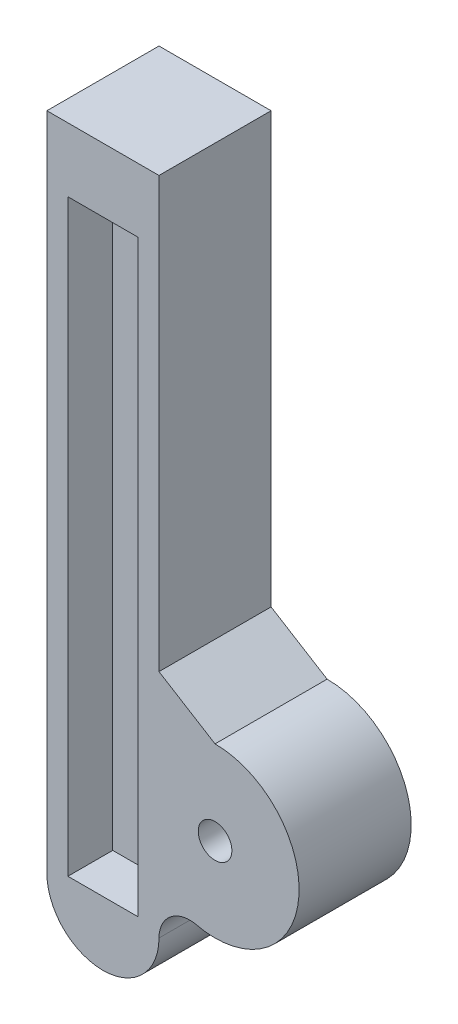
ISO-10303-21;
HEADER;
FILE_DESCRIPTION(('STEP AP214'),'2;1');
FILE_NAME('part.step','',(''),(''),'','','');
FILE_SCHEMA(('AUTOMOTIVE_DESIGN { 1 0 10303 214 1 1 1 1 }'));
ENDSEC;
DATA;
#1=APPLICATION_CONTEXT('core data for automotive mechanical design processes');
#2=APPLICATION_PROTOCOL_DEFINITION('international standard','automotive_design',2000,#1);
#3=PRODUCT_CONTEXT('',#1,'mechanical');
#4=PRODUCT('Part','Part','',(#3));
#5=PRODUCT_RELATED_PRODUCT_CATEGORY('part','',(#4));
#6=PRODUCT_DEFINITION_FORMATION('','',#4);
#7=PRODUCT_DEFINITION_CONTEXT('part definition',#1,'design');
#8=PRODUCT_DEFINITION('design','',#6,#7);
#9=PRODUCT_DEFINITION_SHAPE('','',#8);
#10=(LENGTH_UNIT() NAMED_UNIT(*) SI_UNIT(.MILLI.,.METRE.));
#11=(NAMED_UNIT(*) PLANE_ANGLE_UNIT() SI_UNIT($,.RADIAN.));
#12=(NAMED_UNIT(*) SI_UNIT($,.STERADIAN.) SOLID_ANGLE_UNIT());
#13=UNCERTAINTY_MEASURE_WITH_UNIT(LENGTH_MEASURE(1.E-05),#10,'distance_accuracy_value','');
#14=(GEOMETRIC_REPRESENTATION_CONTEXT(3) GLOBAL_UNCERTAINTY_ASSIGNED_CONTEXT((#13)) GLOBAL_UNIT_ASSIGNED_CONTEXT((#10,
#11,#12)) REPRESENTATION_CONTEXT('',''));
#15=CARTESIAN_POINT('',(0.,0.,0.));
#16=DIRECTION('',(0.,0.,1.));
#17=DIRECTION('',(1.,0.,0.));
#18=AXIS2_PLACEMENT_3D('',#15,#16,#17);
#19=CARTESIAN_POINT('',(-4.47293048602584,-20.,0.));
#20=DIRECTION('',(0.,0.,-1.));
#21=DIRECTION('',(-1.,0.,0.));
#22=AXIS2_PLACEMENT_3D('',#19,#20,#21);
#23=PLANE('',#22);
#24=DIRECTION('',(0.,-1.,0.));
#25=VECTOR('',#24,1.);
#26=CARTESIAN_POINT('',(-26.2499999999999,-18.5850000000001,0.));
#27=LINE('',#26,#25);
#28=CARTESIAN_POINT('',(-26.2500000000003,86.4149999999999,0.));
#29=VERTEX_POINT('',#28);
#30=CARTESIAN_POINT('',(-26.2499999999999,-18.5850000000001,0.));
#31=VERTEX_POINT('',#30);
#32=EDGE_CURVE('E179',#29,#31,#27,.T.);
#33=ORIENTED_EDGE('',*,*,#32,.F.);
#34=DIRECTION('',(-1.,0.,0.));
#35=VECTOR('',#34,1.);
#36=CARTESIAN_POINT('',(-26.2500000000003,86.4149999999999,0.));
#37=LINE('',#36,#35);
#38=CARTESIAN_POINT('',(-13.7500000000003,86.4149999999999,0.));
#39=VERTEX_POINT('',#38);
#40=EDGE_CURVE('E58',#39,#29,#37,.T.);
#41=ORIENTED_EDGE('',*,*,#40,.F.);
#42=DIRECTION('',(0.,1.,0.));
#43=VECTOR('',#42,1.);
#44=CARTESIAN_POINT('',(-13.7499999999999,-18.5850000000001,0.));
#45=LINE('',#44,#43);
#46=CARTESIAN_POINT('',(-13.7499999999999,-18.5850000000001,0.));
#47=VERTEX_POINT('',#46);
#48=EDGE_CURVE('E170',#47,#39,#45,.T.);
#49=ORIENTED_EDGE('',*,*,#48,.F.);
#50=DIRECTION('',(1.,0.,0.));
#51=VECTOR('',#50,1.);
#52=CARTESIAN_POINT('',(-26.2499999999999,-18.5850000000001,0.));
#53=LINE('',#52,#51);
#54=EDGE_CURVE('E173',#31,#47,#53,.T.);
#55=ORIENTED_EDGE('',*,*,#54,.F.);
#56=EDGE_LOOP('',(#33,#41,#49,#55));
#57=FACE_BOUND('',#56,.T.);
#58=CARTESIAN_POINT('',(-4.47293048602584,-20.,0.));
#59=DIRECTION('',(0.,0.,-1.));
#60=DIRECTION('',(-1.,0.,0.));
#61=AXIS2_PLACEMENT_3D('',#58,#59,#60);
#62=CIRCLE('',#61,5.52706951397407);
#63=CARTESIAN_POINT('',(-9.99999999999993,-20.,0.));
#64=VERTEX_POINT('',#63);
#65=CARTESIAN_POINT('',(-3.77527475506118,-14.5171381657611,0.));
#66=VERTEX_POINT('',#65);
#67=EDGE_CURVE('E225',#64,#66,#62,.T.);
#68=ORIENTED_EDGE('',*,*,#67,.T.);
#69=CARTESIAN_POINT('',(0.,0.,0.));
#70=DIRECTION('',(0.,0.,1.));
#71=DIRECTION('',(1.,0.,0.));
#72=AXIS2_PLACEMENT_3D('',#69,#70,#71);
#73=CIRCLE('',#72,15.);
#74=CARTESIAN_POINT('',(0.,15.,0.));
#75=VERTEX_POINT('',#74);
#76=EDGE_CURVE('E228',#66,#75,#73,.T.);
#77=ORIENTED_EDGE('',*,*,#76,.T.);
#78=DIRECTION('',(-0.851405334552162,0.524508299549323,0.));
#79=VECTOR('',#78,1.);
#80=CARTESIAN_POINT('',(0.,15.,0.));
#81=LINE('',#80,#79);
#82=CARTESIAN_POINT('',(-10.0000000000001,21.1605005073784,0.));
#83=VERTEX_POINT('',#82);
#84=EDGE_CURVE('E231',#75,#83,#81,.T.);
#85=ORIENTED_EDGE('',*,*,#84,.T.);
#86=DIRECTION('',(0.,1.,0.));
#87=VECTOR('',#86,1.);
#88=CARTESIAN_POINT('',(-10.0000000000004,97.83,0.));
#89=LINE('',#88,#87);
#90=CARTESIAN_POINT('',(-10.0000000000004,97.83,0.));
#91=VERTEX_POINT('',#90);
#92=EDGE_CURVE('E233',#83,#91,#89,.T.);
#93=ORIENTED_EDGE('',*,*,#92,.T.);
#94=DIRECTION('',(-1.,0.,0.));
#95=VECTOR('',#94,1.);
#96=CARTESIAN_POINT('',(-30.0000000000004,97.8299999999999,1.05384451165591E-13));
#97=LINE('',#96,#95);
#98=CARTESIAN_POINT('',(-30.0000000000004,97.8299999999999,1.05384451165591E-13));
#99=VERTEX_POINT('',#98);
#100=EDGE_CURVE('E235',#91,#99,#97,.T.);
#101=ORIENTED_EDGE('',*,*,#100,.T.);
#102=DIRECTION('',(0.,-1.,0.));
#103=VECTOR('',#102,1.);
#104=CARTESIAN_POINT('',(-29.9999999999999,-20.0000000000001,1.05384451165591E-13));
#105=LINE('',#104,#103);
#106=CARTESIAN_POINT('',(-29.9999999999999,-20.0000000000001,1.05384451165591E-13));
#107=VERTEX_POINT('',#106);
#108=EDGE_CURVE('E237',#99,#107,#105,.T.);
#109=ORIENTED_EDGE('',*,*,#108,.T.);
#110=CARTESIAN_POINT('',(-19.9999999999999,-20.0000000000001,0.));
#111=DIRECTION('',(0.,0.,1.));
#112=DIRECTION('',(-1.,0.,0.));
#113=AXIS2_PLACEMENT_3D('',#110,#111,#112);
#114=CIRCLE('',#113,10.);
#115=EDGE_CURVE('E239',#107,#64,#114,.T.);
#116=ORIENTED_EDGE('',*,*,#115,.T.);
#117=EDGE_LOOP('',(#68,#77,#85,#93,#101,#109,#116));
#118=FACE_BOUND('',#117,.T.);
#119=CARTESIAN_POINT('',(0.,0.,0.));
#120=DIRECTION('',(0.,0.,1.));
#121=DIRECTION('',(1.,0.,0.));
#122=AXIS2_PLACEMENT_3D('',#119,#120,#121);
#123=CIRCLE('',#122,3.);
#124=CARTESIAN_POINT('',(3.,0.,0.));
#125=VERTEX_POINT('',#124);
#126=EDGE_CURVE('E219',#125,#125,#123,.T.);
#127=ORIENTED_EDGE('',*,*,#126,.F.);
#128=EDGE_LOOP('',(#127));
#129=FACE_BOUND('',#128,.T.);
#130=ADVANCED_FACE('F43',(#57,#118,#129),#23,.F.);
#131=CARTESIAN_POINT('',(-4.47293048602591,-20.,-20.));
#132=DIRECTION('',(0.,0.,-1.));
#133=DIRECTION('',(-1.,0.,0.));
#134=AXIS2_PLACEMENT_3D('',#131,#132,#133);
#135=PLANE('',#134);
#136=DIRECTION('',(1.,0.,0.));
#137=VECTOR('',#136,1.);
#138=CARTESIAN_POINT('',(-14.0000000000004,86.415,-19.9999999999999));
#139=LINE('',#138,#137);
#140=CARTESIAN_POINT('',(-26.5000000000004,86.4149999999999,-19.9999999999999));
#141=VERTEX_POINT('',#140);
#142=CARTESIAN_POINT('',(-14.0000000000004,86.415,-19.9999999999999));
#143=VERTEX_POINT('',#142);
#144=EDGE_CURVE('E66',#141,#143,#139,.T.);
#145=ORIENTED_EDGE('',*,*,#144,.F.);
#146=DIRECTION('',(0.,1.,0.));
#147=VECTOR('',#146,1.);
#148=CARTESIAN_POINT('',(-26.5,-18.5850000000001,-19.9999999999999));
#149=LINE('',#148,#147);
#150=CARTESIAN_POINT('',(-26.5,-18.5850000000001,-19.9999999999999));
#151=VERTEX_POINT('',#150);
#152=EDGE_CURVE('E192',#151,#141,#149,.T.);
#153=ORIENTED_EDGE('',*,*,#152,.F.);
#154=DIRECTION('',(-1.,0.,0.));
#155=VECTOR('',#154,1.);
#156=CARTESIAN_POINT('',(-14.,-18.585,-19.9999999999999));
#157=LINE('',#156,#155);
#158=CARTESIAN_POINT('',(-14.,-18.585,-19.9999999999999));
#159=VERTEX_POINT('',#158);
#160=EDGE_CURVE('E206',#159,#151,#157,.T.);
#161=ORIENTED_EDGE('',*,*,#160,.F.);
#162=DIRECTION('',(0.,-1.,0.));
#163=VECTOR('',#162,1.);
#164=CARTESIAN_POINT('',(-14.,-18.585,-19.9999999999999));
#165=LINE('',#164,#163);
#166=EDGE_CURVE('E203',#143,#159,#165,.T.);
#167=ORIENTED_EDGE('',*,*,#166,.F.);
#168=EDGE_LOOP('',(#145,#153,#161,#167));
#169=FACE_BOUND('',#168,.T.);
#170=CARTESIAN_POINT('',(-4.47293048602591,-20.,-20.));
#171=DIRECTION('',(0.,0.,-1.));
#172=DIRECTION('',(-1.,0.,0.));
#173=AXIS2_PLACEMENT_3D('',#170,#171,#172);
#174=CIRCLE('',#173,5.52706951397407);
#175=CARTESIAN_POINT('',(-9.99999999999999,-20.,-20.));
#176=VERTEX_POINT('',#175);
#177=CARTESIAN_POINT('',(-3.77527475506124,-14.5171381657611,-20.));
#178=VERTEX_POINT('',#177);
#179=EDGE_CURVE('E222',#176,#178,#174,.T.);
#180=ORIENTED_EDGE('',*,*,#179,.F.);
#181=CARTESIAN_POINT('',(-20.,-20.0000000000001,-19.9999999999999));
#182=DIRECTION('',(0.,0.,1.));
#183=DIRECTION('',(-1.,0.,0.));
#184=AXIS2_PLACEMENT_3D('',#181,#182,#183);
#185=CIRCLE('',#184,10.);
#186=CARTESIAN_POINT('',(-30.,-20.0000000000001,-19.9999999999999));
#187=VERTEX_POINT('',#186);
#188=EDGE_CURVE('E229',#187,#176,#185,.T.);
#189=ORIENTED_EDGE('',*,*,#188,.F.);
#190=DIRECTION('',(0.,-1.,0.));
#191=VECTOR('',#190,1.);
#192=CARTESIAN_POINT('',(-30.,-20.0000000000001,-19.9999999999999));
#193=LINE('',#192,#191);
#194=CARTESIAN_POINT('',(-30.0000000000004,97.8299999999999,-19.9999999999999));
#195=VERTEX_POINT('',#194);
#196=EDGE_CURVE('E252',#195,#187,#193,.T.);
#197=ORIENTED_EDGE('',*,*,#196,.F.);
#198=DIRECTION('',(-1.,0.,0.));
#199=VECTOR('',#198,1.);
#200=CARTESIAN_POINT('',(-30.0000000000004,97.8299999999999,-19.9999999999999));
#201=LINE('',#200,#199);
#202=CARTESIAN_POINT('',(-10.0000000000004,97.83,-20.));
#203=VERTEX_POINT('',#202);
#204=EDGE_CURVE('E250',#203,#195,#201,.T.);
#205=ORIENTED_EDGE('',*,*,#204,.F.);
#206=DIRECTION('',(0.,1.,0.));
#207=VECTOR('',#206,1.);
#208=CARTESIAN_POINT('',(-10.0000000000004,97.83,-20.));
#209=LINE('',#208,#207);
#210=CARTESIAN_POINT('',(-10.0000000000001,21.1605005073784,-20.));
#211=VERTEX_POINT('',#210);
#212=EDGE_CURVE('E248',#211,#203,#209,.T.);
#213=ORIENTED_EDGE('',*,*,#212,.F.);
#214=DIRECTION('',(-0.851405334552162,0.524508299549323,0.));
#215=VECTOR('',#214,1.);
#216=CARTESIAN_POINT('',(-1.17961196366423E-13,15.,-20.));
#217=LINE('',#216,#215);
#218=CARTESIAN_POINT('',(-1.17961196366423E-13,15.,-20.));
#219=VERTEX_POINT('',#218);
#220=EDGE_CURVE('E246',#219,#211,#217,.T.);
#221=ORIENTED_EDGE('',*,*,#220,.F.);
#222=CARTESIAN_POINT('',(0.,0.,-20.));
#223=DIRECTION('',(0.,0.,1.));
#224=DIRECTION('',(1.,0.,0.));
#225=AXIS2_PLACEMENT_3D('',#222,#223,#224);
#226=CIRCLE('',#225,15.);
#227=EDGE_CURVE('E244',#178,#219,#226,.T.);
#228=ORIENTED_EDGE('',*,*,#227,.F.);
#229=EDGE_LOOP('',(#180,#189,#197,#205,#213,#221,#228));
#230=FACE_BOUND('',#229,.T.);
#231=CARTESIAN_POINT('',(0.,0.,-20.));
#232=DIRECTION('',(0.,0.,1.));
#233=DIRECTION('',(1.,0.,0.));
#234=AXIS2_PLACEMENT_3D('',#231,#232,#233);
#235=CIRCLE('',#234,3.);
#236=CARTESIAN_POINT('',(2.99999999999993,0.,-20.));
#237=VERTEX_POINT('',#236);
#238=EDGE_CURVE('E213',#237,#237,#235,.T.);
#239=ORIENTED_EDGE('',*,*,#238,.T.);
#240=EDGE_LOOP('',(#239));
#241=FACE_BOUND('',#240,.T.);
#242=ADVANCED_FACE('F279',(#169,#230,#241),#135,.T.);
#243=CARTESIAN_POINT('',(-4.47293048602584,-20.,0.));
#244=DIRECTION('',(0.,0.,-1.));
#245=DIRECTION('',(-1.,0.,0.));
#246=AXIS2_PLACEMENT_3D('',#243,#244,#245);
#247=CYLINDRICAL_SURFACE('',#246,5.52706951397407);
#248=ORIENTED_EDGE('',*,*,#179,.T.);
#249=DIRECTION('',(0.,0.,-1.));
#250=VECTOR('',#249,1.);
#251=CARTESIAN_POINT('',(-3.77527475506118,-14.5171381657611,0.));
#252=LINE('',#251,#250);
#253=EDGE_CURVE('E11',#66,#178,#252,.T.);
#254=ORIENTED_EDGE('',*,*,#253,.F.);
#255=ORIENTED_EDGE('',*,*,#67,.F.);
#256=DIRECTION('',(0.,0.,-1.));
#257=VECTOR('',#256,1.);
#258=CARTESIAN_POINT('',(-9.99999999999993,-20.,0.));
#259=LINE('',#258,#257);
#260=EDGE_CURVE('E241',#64,#176,#259,.T.);
#261=ORIENTED_EDGE('',*,*,#260,.T.);
#262=EDGE_LOOP('',(#248,#254,#255,#261));
#263=FACE_BOUND('',#262,.T.);
#264=ADVANCED_FACE('F45',(#263),#247,.F.);
#265=CARTESIAN_POINT('',(0.,0.,0.));
#266=DIRECTION('',(0.,0.,-1.));
#267=DIRECTION('',(-1.,0.,0.));
#268=AXIS2_PLACEMENT_3D('',#265,#266,#267);
#269=CYLINDRICAL_SURFACE('',#268,15.);
#270=ORIENTED_EDGE('',*,*,#227,.T.);
#271=DIRECTION('',(0.,0.,-1.));
#272=VECTOR('',#271,1.);
#273=CARTESIAN_POINT('',(0.,15.,0.));
#274=LINE('',#273,#272);
#275=EDGE_CURVE('E51',#75,#219,#274,.T.);
#276=ORIENTED_EDGE('',*,*,#275,.F.);
#277=ORIENTED_EDGE('',*,*,#76,.F.);
#278=ORIENTED_EDGE('',*,*,#253,.T.);
#279=EDGE_LOOP('',(#270,#276,#277,#278));
#280=FACE_BOUND('',#279,.T.);
#281=ADVANCED_FACE('F297',(#280),#269,.T.);
#282=CARTESIAN_POINT('',(0.,15.,0.));
#283=DIRECTION('',(-0.524508299549323,-0.851405334552162,0.));
#284=DIRECTION('',(0.851405334552162,-0.524508299549323,0.));
#285=AXIS2_PLACEMENT_3D('',#282,#283,#284);
#286=PLANE('',#285);
#287=ORIENTED_EDGE('',*,*,#220,.T.);
#288=DIRECTION('',(0.,0.,-1.));
#289=VECTOR('',#288,1.);
#290=CARTESIAN_POINT('',(-10.0000000000001,21.1605005073784,0.));
#291=LINE('',#290,#289);
#292=EDGE_CURVE('E266',#83,#211,#291,.T.);
#293=ORIENTED_EDGE('',*,*,#292,.F.);
#294=ORIENTED_EDGE('',*,*,#84,.F.);
#295=ORIENTED_EDGE('',*,*,#275,.T.);
#296=EDGE_LOOP('',(#287,#293,#294,#295));
#297=FACE_BOUND('',#296,.T.);
#298=ADVANCED_FACE('F273',(#297),#286,.F.);
#299=CARTESIAN_POINT('',(-10.0000000000004,97.83,0.));
#300=DIRECTION('',(-1.,0.,0.));
#301=DIRECTION('',(0.,-1.,0.));
#302=AXIS2_PLACEMENT_3D('',#299,#300,#301);
#303=PLANE('',#302);
#304=ORIENTED_EDGE('',*,*,#212,.T.);
#305=DIRECTION('',(0.,0.,-1.));
#306=VECTOR('',#305,1.);
#307=CARTESIAN_POINT('',(-10.0000000000004,97.83,0.));
#308=LINE('',#307,#306);
#309=EDGE_CURVE('E263',#91,#203,#308,.T.);
#310=ORIENTED_EDGE('',*,*,#309,.F.);
#311=ORIENTED_EDGE('',*,*,#92,.F.);
#312=ORIENTED_EDGE('',*,*,#292,.T.);
#313=EDGE_LOOP('',(#304,#310,#311,#312));
#314=FACE_BOUND('',#313,.T.);
#315=ADVANCED_FACE('F285',(#314),#303,.F.);
#316=CARTESIAN_POINT('',(-30.0000000000004,97.8299999999999,1.05384451165591E-13));
#317=DIRECTION('',(0.,-1.,0.));
#318=DIRECTION('',(1.,0.,0.));
#319=AXIS2_PLACEMENT_3D('',#316,#317,#318);
#320=PLANE('',#319);
#321=ORIENTED_EDGE('',*,*,#204,.T.);
#322=DIRECTION('',(0.,0.,-1.));
#323=VECTOR('',#322,1.);
#324=CARTESIAN_POINT('',(-30.0000000000004,97.8299999999999,1.05384451165591E-13));
#325=LINE('',#324,#323);
#326=EDGE_CURVE('E260',#99,#195,#325,.T.);
#327=ORIENTED_EDGE('',*,*,#326,.F.);
#328=ORIENTED_EDGE('',*,*,#100,.F.);
#329=ORIENTED_EDGE('',*,*,#309,.T.);
#330=EDGE_LOOP('',(#321,#327,#328,#329));
#331=FACE_BOUND('',#330,.T.);
#332=ADVANCED_FACE('F289',(#331),#320,.F.);
#333=CARTESIAN_POINT('',(-29.9999999999999,-20.0000000000001,1.05384451165591E-13));
#334=DIRECTION('',(1.,0.,0.));
#335=DIRECTION('',(0.,1.,0.));
#336=AXIS2_PLACEMENT_3D('',#333,#334,#335);
#337=PLANE('',#336);
#338=ORIENTED_EDGE('',*,*,#196,.T.);
#339=DIRECTION('',(0.,0.,-1.));
#340=VECTOR('',#339,1.);
#341=CARTESIAN_POINT('',(-29.9999999999999,-20.0000000000001,1.05384451165591E-13));
#342=LINE('',#341,#340);
#343=EDGE_CURVE('E257',#107,#187,#342,.T.);
#344=ORIENTED_EDGE('',*,*,#343,.F.);
#345=ORIENTED_EDGE('',*,*,#108,.F.);
#346=ORIENTED_EDGE('',*,*,#326,.T.);
#347=EDGE_LOOP('',(#338,#344,#345,#346));
#348=FACE_BOUND('',#347,.T.);
#349=ADVANCED_FACE('F305',(#348),#337,.F.);
#350=CARTESIAN_POINT('',(-19.9999999999999,-20.0000000000001,0.));
#351=DIRECTION('',(0.,0.,-1.));
#352=DIRECTION('',(-1.,0.,0.));
#353=AXIS2_PLACEMENT_3D('',#350,#351,#352);
#354=CYLINDRICAL_SURFACE('',#353,10.);
#355=ORIENTED_EDGE('',*,*,#188,.T.);
#356=ORIENTED_EDGE('',*,*,#260,.F.);
#357=ORIENTED_EDGE('',*,*,#115,.F.);
#358=ORIENTED_EDGE('',*,*,#343,.T.);
#359=EDGE_LOOP('',(#355,#356,#357,#358));
#360=FACE_BOUND('',#359,.T.);
#361=ADVANCED_FACE('F302',(#360),#354,.T.);
#362=CARTESIAN_POINT('',(0.,0.,0.));
#363=DIRECTION('',(0.,0.,-1.));
#364=DIRECTION('',(-1.,0.,0.));
#365=AXIS2_PLACEMENT_3D('',#362,#363,#364);
#366=CYLINDRICAL_SURFACE('',#365,3.);
#367=ORIENTED_EDGE('',*,*,#126,.T.);
#368=EDGE_LOOP('',(#367));
#369=FACE_BOUND('',#368,.T.);
#370=ORIENTED_EDGE('',*,*,#238,.F.);
#371=EDGE_LOOP('',(#370));
#372=FACE_BOUND('',#371,.T.);
#373=ADVANCED_FACE('F312',(#369,#372),#366,.F.);
#374=CARTESIAN_POINT('',(-14.0000000000003,86.415,-11.9999999999999));
#375=DIRECTION('',(0.,1.,0.));
#376=DIRECTION('',(-1.,0.,0.));
#377=AXIS2_PLACEMENT_3D('',#374,#375,#376);
#378=PLANE('',#377);
#379=ORIENTED_EDGE('',*,*,#144,.T.);
#380=DIRECTION('',(0.,0.,-1.));
#381=VECTOR('',#380,1.);
#382=CARTESIAN_POINT('',(-14.0000000000003,86.415,-11.9999999999999));
#383=LINE('',#382,#381);
#384=CARTESIAN_POINT('',(-14.0000000000003,86.415,-11.9999999999999));
#385=VERTEX_POINT('',#384);
#386=EDGE_CURVE('E201',#385,#143,#383,.T.);
#387=ORIENTED_EDGE('',*,*,#386,.F.);
#388=DIRECTION('',(1.,0.,0.));
#389=VECTOR('',#388,1.);
#390=CARTESIAN_POINT('',(-14.0000000000003,86.415,-11.9999999999999));
#391=LINE('',#390,#389);
#392=CARTESIAN_POINT('',(-26.5000000000003,86.4149999999999,-11.9999999999999));
#393=VERTEX_POINT('',#392);
#394=EDGE_CURVE('E188',#393,#385,#391,.T.);
#395=ORIENTED_EDGE('',*,*,#394,.F.);
#396=DIRECTION('',(0.,0.,-1.));
#397=VECTOR('',#396,1.);
#398=CARTESIAN_POINT('',(-26.5000000000003,86.4149999999999,-11.9999999999999));
#399=LINE('',#398,#397);
#400=EDGE_CURVE('E211',#393,#141,#399,.T.);
#401=ORIENTED_EDGE('',*,*,#400,.T.);
#402=EDGE_LOOP('',(#379,#387,#395,#401));
#403=FACE_BOUND('',#402,.T.);
#404=ADVANCED_FACE('F326',(#403),#378,.F.);
#405=CARTESIAN_POINT('',(-26.5,-18.5850000000001,-11.9999999999999));
#406=DIRECTION('',(-1.,0.,0.));
#407=DIRECTION('',(0.,-1.,0.));
#408=AXIS2_PLACEMENT_3D('',#405,#406,#407);
#409=PLANE('',#408);
#410=ORIENTED_EDGE('',*,*,#152,.T.);
#411=ORIENTED_EDGE('',*,*,#400,.F.);
#412=DIRECTION('',(0.,1.,0.));
#413=VECTOR('',#412,1.);
#414=CARTESIAN_POINT('',(-26.5,-18.5850000000001,-11.9999999999999));
#415=LINE('',#414,#413);
#416=CARTESIAN_POINT('',(-26.5,-18.5850000000001,-11.9999999999999));
#417=VERTEX_POINT('',#416);
#418=EDGE_CURVE('E198',#417,#393,#415,.T.);
#419=ORIENTED_EDGE('',*,*,#418,.F.);
#420=DIRECTION('',(0.,0.,-1.));
#421=VECTOR('',#420,1.);
#422=CARTESIAN_POINT('',(-26.5,-18.5850000000001,-11.9999999999999));
#423=LINE('',#422,#421);
#424=EDGE_CURVE('E214',#417,#151,#423,.T.);
#425=ORIENTED_EDGE('',*,*,#424,.T.);
#426=EDGE_LOOP('',(#410,#411,#419,#425));
#427=FACE_BOUND('',#426,.T.);
#428=ADVANCED_FACE('F330',(#427),#409,.F.);
#429=CARTESIAN_POINT('',(-14.,-18.585,-11.9999999999999));
#430=DIRECTION('',(0.,-1.,0.));
#431=DIRECTION('',(1.,0.,0.));
#432=AXIS2_PLACEMENT_3D('',#429,#430,#431);
#433=PLANE('',#432);
#434=ORIENTED_EDGE('',*,*,#160,.T.);
#435=ORIENTED_EDGE('',*,*,#424,.F.);
#436=DIRECTION('',(-1.,0.,0.));
#437=VECTOR('',#436,1.);
#438=CARTESIAN_POINT('',(-14.,-18.585,-11.9999999999999));
#439=LINE('',#438,#437);
#440=CARTESIAN_POINT('',(-14.,-18.585,-11.9999999999999));
#441=VERTEX_POINT('',#440);
#442=EDGE_CURVE('E195',#441,#417,#439,.T.);
#443=ORIENTED_EDGE('',*,*,#442,.F.);
#444=DIRECTION('',(0.,0.,-1.));
#445=VECTOR('',#444,1.);
#446=CARTESIAN_POINT('',(-14.,-18.585,-11.9999999999999));
#447=LINE('',#446,#445);
#448=EDGE_CURVE('E216',#441,#159,#447,.T.);
#449=ORIENTED_EDGE('',*,*,#448,.T.);
#450=EDGE_LOOP('',(#434,#435,#443,#449));
#451=FACE_BOUND('',#450,.T.);
#452=ADVANCED_FACE('F335',(#451),#433,.F.);
#453=CARTESIAN_POINT('',(-14.,-18.585,-11.9999999999999));
#454=DIRECTION('',(1.,0.,0.));
#455=DIRECTION('',(0.,1.,0.));
#456=AXIS2_PLACEMENT_3D('',#453,#454,#455);
#457=PLANE('',#456);
#458=ORIENTED_EDGE('',*,*,#166,.T.);
#459=ORIENTED_EDGE('',*,*,#448,.F.);
#460=DIRECTION('',(0.,-1.,0.));
#461=VECTOR('',#460,1.);
#462=CARTESIAN_POINT('',(-14.,-18.585,-11.9999999999999));
#463=LINE('',#462,#461);
#464=EDGE_CURVE('E191',#385,#441,#463,.T.);
#465=ORIENTED_EDGE('',*,*,#464,.F.);
#466=ORIENTED_EDGE('',*,*,#386,.T.);
#467=EDGE_LOOP('',(#458,#459,#465,#466));
#468=FACE_BOUND('',#467,.T.);
#469=ADVANCED_FACE('F331',(#468),#457,.F.);
#470=CARTESIAN_POINT('',(0.,0.,-12.));
#471=DIRECTION('',(0.,0.,-1.));
#472=DIRECTION('',(-1.,0.,0.));
#473=AXIS2_PLACEMENT_3D('',#470,#471,#472);
#474=PLANE('',#473);
#475=ORIENTED_EDGE('',*,*,#394,.T.);
#476=ORIENTED_EDGE('',*,*,#464,.T.);
#477=ORIENTED_EDGE('',*,*,#442,.T.);
#478=ORIENTED_EDGE('',*,*,#418,.T.);
#479=EDGE_LOOP('',(#475,#476,#477,#478));
#480=FACE_BOUND('',#479,.T.);
#481=ADVANCED_FACE('F334',(#480),#474,.T.);
#482=CARTESIAN_POINT('',(-26.2500000000003,86.4149999999999,-7.99999999999991));
#483=DIRECTION('',(0.,1.,0.));
#484=DIRECTION('',(-1.,0.,0.));
#485=AXIS2_PLACEMENT_3D('',#482,#483,#484);
#486=PLANE('',#485);
#487=ORIENTED_EDGE('',*,*,#40,.T.);
#488=DIRECTION('',(0.,0.,1.));
#489=VECTOR('',#488,1.);
#490=CARTESIAN_POINT('',(-26.2500000000003,86.4149999999999,-7.99999999999991));
#491=LINE('',#490,#489);
#492=CARTESIAN_POINT('',(-26.2500000000003,86.4149999999999,-7.99999999999991));
#493=VERTEX_POINT('',#492);
#494=EDGE_CURVE('E148',#493,#29,#491,.T.);
#495=ORIENTED_EDGE('',*,*,#494,.F.);
#496=DIRECTION('',(-1.,0.,0.));
#497=VECTOR('',#496,1.);
#498=CARTESIAN_POINT('',(-26.2500000000003,86.4149999999999,-7.99999999999991));
#499=LINE('',#498,#497);
#500=CARTESIAN_POINT('',(-13.7500000000003,86.4149999999999,-7.99999999999995));
#501=VERTEX_POINT('',#500);
#502=EDGE_CURVE('E152',#501,#493,#499,.T.);
#503=ORIENTED_EDGE('',*,*,#502,.F.);
#504=DIRECTION('',(0.,0.,1.));
#505=VECTOR('',#504,1.);
#506=CARTESIAN_POINT('',(-13.7500000000003,86.4149999999999,-7.99999999999995));
#507=LINE('',#506,#505);
#508=EDGE_CURVE('E183',#501,#39,#507,.T.);
#509=ORIENTED_EDGE('',*,*,#508,.T.);
#510=EDGE_LOOP('',(#487,#495,#503,#509));
#511=FACE_BOUND('',#510,.T.);
#512=ADVANCED_FACE('F150',(#511),#486,.F.);
#513=CARTESIAN_POINT('',(-13.75,-18.5850000000001,-7.99999999999995));
#514=DIRECTION('',(1.,0.,0.));
#515=DIRECTION('',(0.,1.,0.));
#516=AXIS2_PLACEMENT_3D('',#513,#514,#515);
#517=PLANE('',#516);
#518=ORIENTED_EDGE('',*,*,#48,.T.);
#519=ORIENTED_EDGE('',*,*,#508,.F.);
#520=DIRECTION('',(0.,1.,0.));
#521=VECTOR('',#520,1.);
#522=CARTESIAN_POINT('',(-13.75,-18.5850000000001,-7.99999999999995));
#523=LINE('',#522,#521);
#524=CARTESIAN_POINT('',(-13.75,-18.5850000000001,-7.99999999999995));
#525=VERTEX_POINT('',#524);
#526=EDGE_CURVE('E158',#525,#501,#523,.T.);
#527=ORIENTED_EDGE('',*,*,#526,.F.);
#528=DIRECTION('',(0.,0.,1.));
#529=VECTOR('',#528,1.);
#530=CARTESIAN_POINT('',(-13.75,-18.5850000000001,-7.99999999999995));
#531=LINE('',#530,#529);
#532=EDGE_CURVE('E185',#525,#47,#531,.T.);
#533=ORIENTED_EDGE('',*,*,#532,.T.);
#534=EDGE_LOOP('',(#518,#519,#527,#533));
#535=FACE_BOUND('',#534,.T.);
#536=ADVANCED_FACE('F348',(#535),#517,.F.);
#537=CARTESIAN_POINT('',(-26.25,-18.5850000000001,-7.99999999999991));
#538=DIRECTION('',(0.,-1.,0.));
#539=DIRECTION('',(1.,0.,0.));
#540=AXIS2_PLACEMENT_3D('',#537,#538,#539);
#541=PLANE('',#540);
#542=ORIENTED_EDGE('',*,*,#54,.T.);
#543=ORIENTED_EDGE('',*,*,#532,.F.);
#544=DIRECTION('',(1.,0.,0.));
#545=VECTOR('',#544,1.);
#546=CARTESIAN_POINT('',(-26.25,-18.5850000000001,-7.99999999999991));
#547=LINE('',#546,#545);
#548=CARTESIAN_POINT('',(-26.25,-18.5850000000001,-7.99999999999991));
#549=VERTEX_POINT('',#548);
#550=EDGE_CURVE('E166',#549,#525,#547,.T.);
#551=ORIENTED_EDGE('',*,*,#550,.F.);
#552=DIRECTION('',(0.,0.,1.));
#553=VECTOR('',#552,1.);
#554=CARTESIAN_POINT('',(-26.25,-18.5850000000001,-7.99999999999991));
#555=LINE('',#554,#553);
#556=EDGE_CURVE('E157',#549,#31,#555,.T.);
#557=ORIENTED_EDGE('',*,*,#556,.T.);
#558=EDGE_LOOP('',(#542,#543,#551,#557));
#559=FACE_BOUND('',#558,.T.);
#560=ADVANCED_FACE('F351',(#559),#541,.F.);
#561=CARTESIAN_POINT('',(-26.25,-18.5850000000001,-7.99999999999991));
#562=DIRECTION('',(-1.,0.,0.));
#563=DIRECTION('',(0.,-1.,0.));
#564=AXIS2_PLACEMENT_3D('',#561,#562,#563);
#565=PLANE('',#564);
#566=ORIENTED_EDGE('',*,*,#32,.T.);
#567=ORIENTED_EDGE('',*,*,#556,.F.);
#568=DIRECTION('',(0.,-1.,0.));
#569=VECTOR('',#568,1.);
#570=CARTESIAN_POINT('',(-26.25,-18.5850000000001,-7.99999999999991));
#571=LINE('',#570,#569);
#572=EDGE_CURVE('E161',#493,#549,#571,.T.);
#573=ORIENTED_EDGE('',*,*,#572,.F.);
#574=ORIENTED_EDGE('',*,*,#494,.T.);
#575=EDGE_LOOP('',(#566,#567,#573,#574));
#576=FACE_BOUND('',#575,.T.);
#577=ADVANCED_FACE('F162',(#576),#565,.F.);
#578=CARTESIAN_POINT('',(0.,0.,-7.99999999999999));
#579=DIRECTION('',(0.,0.,1.));
#580=DIRECTION('',(1.,0.,0.));
#581=AXIS2_PLACEMENT_3D('',#578,#579,#580);
#582=PLANE('',#581);
#583=ORIENTED_EDGE('',*,*,#502,.T.);
#584=ORIENTED_EDGE('',*,*,#572,.T.);
#585=ORIENTED_EDGE('',*,*,#550,.T.);
#586=ORIENTED_EDGE('',*,*,#526,.T.);
#587=EDGE_LOOP('',(#583,#584,#585,#586));
#588=FACE_BOUND('',#587,.T.);
#589=ADVANCED_FACE('F168',(#588),#582,.T.);
#590=CLOSED_SHELL('',(#130,#242,#264,#281,#298,#315,#332,#349,#361,#373,#404,#428,#452,#469,
#481,#512,#536,#560,#577,#589));
#591=MANIFOLD_SOLID_BREP('B2',#590);
#592=ADVANCED_BREP_SHAPE_REPRESENTATION('',(#18,#591),#14);
#593=SHAPE_DEFINITION_REPRESENTATION(#9,#592);
ENDSEC;
END-ISO-10303-21;
